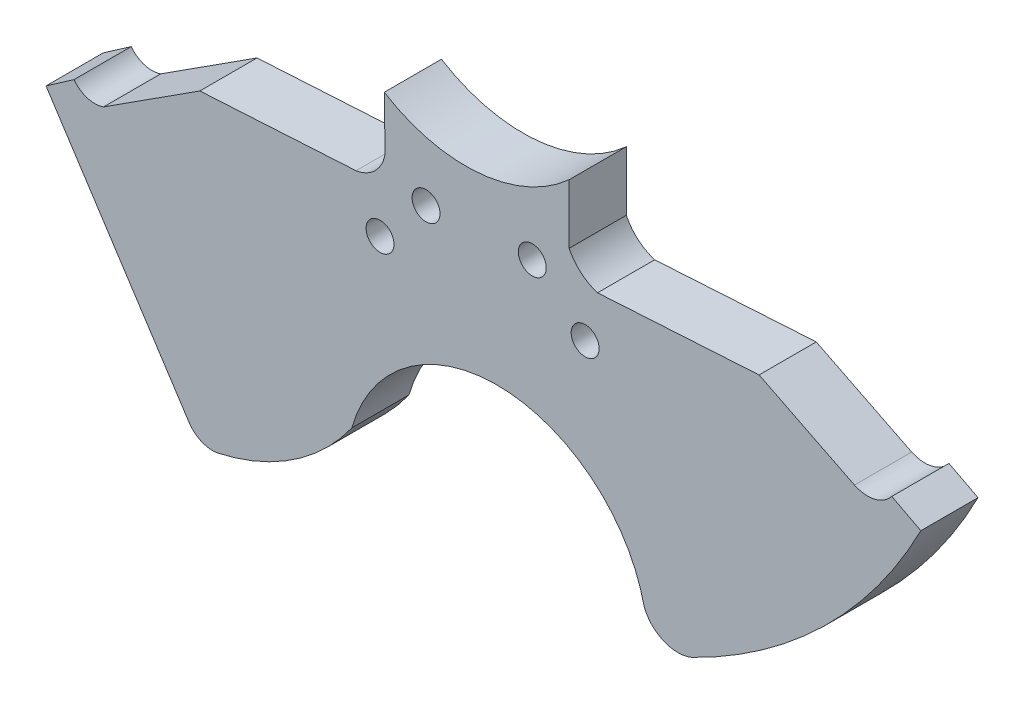
ISO-10303-21;
HEADER;
FILE_DESCRIPTION(('STEP AP214'),'2;1');
FILE_NAME('part.step','',(''),(''),'','','');
FILE_SCHEMA(('AUTOMOTIVE_DESIGN { 1 0 10303 214 1 1 1 1 }'));
ENDSEC;
DATA;
#1=APPLICATION_CONTEXT('core data for automotive mechanical design processes');
#2=APPLICATION_PROTOCOL_DEFINITION('international standard','automotive_design',2000,#1);
#3=PRODUCT_CONTEXT('',#1,'mechanical');
#4=PRODUCT('Part','Part','',(#3));
#5=PRODUCT_RELATED_PRODUCT_CATEGORY('part','',(#4));
#6=PRODUCT_DEFINITION_FORMATION('','',#4);
#7=PRODUCT_DEFINITION_CONTEXT('part definition',#1,'design');
#8=PRODUCT_DEFINITION('design','',#6,#7);
#9=PRODUCT_DEFINITION_SHAPE('','',#8);
#10=(LENGTH_UNIT() NAMED_UNIT(*) SI_UNIT(.MILLI.,.METRE.));
#11=(NAMED_UNIT(*) PLANE_ANGLE_UNIT() SI_UNIT($,.RADIAN.));
#12=(NAMED_UNIT(*) SI_UNIT($,.STERADIAN.) SOLID_ANGLE_UNIT());
#13=UNCERTAINTY_MEASURE_WITH_UNIT(LENGTH_MEASURE(1.E-05),#10,'distance_accuracy_value','');
#14=(GEOMETRIC_REPRESENTATION_CONTEXT(3) GLOBAL_UNCERTAINTY_ASSIGNED_CONTEXT((#13)) GLOBAL_UNIT_ASSIGNED_CONTEXT((#10,
#11,#12)) REPRESENTATION_CONTEXT('',''));
#15=CARTESIAN_POINT('',(0.,0.,0.));
#16=DIRECTION('',(0.,0.,1.));
#17=DIRECTION('',(1.,0.,0.));
#18=AXIS2_PLACEMENT_3D('',#15,#16,#17);
#19=CARTESIAN_POINT('',(31.1758611316786,56.598658808303,13.));
#20=DIRECTION('',(0.,0.,1.));
#21=DIRECTION('',(1.,0.,0.));
#22=AXIS2_PLACEMENT_3D('',#19,#20,#21);
#23=PLANE('',#22);
#24=CARTESIAN_POINT('',(125.590943676539,70.9466405765813,13.));
#25=DIRECTION('',(0.,0.,1.));
#26=DIRECTION('',(1.,0.,0.));
#27=AXIS2_PLACEMENT_3D('',#24,#25,#26);
#28=CIRCLE('',#27,3.175);
#29=CARTESIAN_POINT('',(128.765943676539,70.9466405765813,13.));
#30=VERTEX_POINT('',#29);
#31=EDGE_CURVE('E400',#30,#30,#28,.T.);
#32=ORIENTED_EDGE('',*,*,#31,.F.);
#33=EDGE_LOOP('',(#32));
#34=FACE_BOUND('',#33,.T.);
#35=CARTESIAN_POINT('',(89.4219487246209,79.437523552383,13.));
#36=DIRECTION('',(0.,0.,1.));
#37=DIRECTION('',(1.,0.,0.));
#38=AXIS2_PLACEMENT_3D('',#35,#36,#37);
#39=CIRCLE('',#38,3.175);
#40=CARTESIAN_POINT('',(92.5969487246209,79.437523552383,13.));
#41=VERTEX_POINT('',#40);
#42=EDGE_CURVE('E210',#41,#41,#39,.T.);
#43=ORIENTED_EDGE('',*,*,#42,.F.);
#44=EDGE_LOOP('',(#43));
#45=FACE_BOUND('',#44,.T.);
#46=CARTESIAN_POINT('',(31.1758611316786,56.598658808303,13.));
#47=DIRECTION('',(0.,0.,1.));
#48=DIRECTION('',(1.,0.,0.));
#49=AXIS2_PLACEMENT_3D('',#46,#47,#48);
#50=CIRCLE('',#49,50.7268128101961);
#51=CARTESIAN_POINT('',(41.9707942522505,7.03376239155412,13.));
#52=VERTEX_POINT('',#51);
#53=CARTESIAN_POINT('',(72.5465331391852,27.2443229185579,13.));
#54=VERTEX_POINT('',#53);
#55=EDGE_CURVE('E247',#52,#54,#50,.T.);
#56=ORIENTED_EDGE('',*,*,#55,.T.);
#57=CARTESIAN_POINT('',(105.533884862058,17.9301942944366,13.));
#58=DIRECTION('',(0.,0.,-1.));
#59=DIRECTION('',(1.,0.,0.));
#60=AXIS2_PLACEMENT_3D('',#57,#58,#59);
#61=CIRCLE('',#60,34.2770822228963);
#62=CARTESIAN_POINT('',(139.02060050713,25.2485439049202,13.));
#63=VERTEX_POINT('',#62);
#64=EDGE_CURVE('E132',#54,#63,#61,.T.);
#65=ORIENTED_EDGE('',*,*,#64,.T.);
#66=CARTESIAN_POINT('',(146.672078870646,28.3200737362575,13.));
#67=DIRECTION('',(0.,0.,1.));
#68=DIRECTION('',(1.,0.,0.));
#69=AXIS2_PLACEMENT_3D('',#66,#67,#68);
#70=CIRCLE('',#69,8.24496310799132);
#71=CARTESIAN_POINT('',(149.813666262393,20.6970923436426,13.));
#72=VERTEX_POINT('',#71);
#73=EDGE_CURVE('E298',#63,#72,#70,.T.);
#74=ORIENTED_EDGE('',*,*,#73,.T.);
#75=CARTESIAN_POINT('',(99.1919266210141,124.512117825493,13.));
#76=DIRECTION('',(0.,0.,1.));
#77=DIRECTION('',(1.,0.,0.));
#78=AXIS2_PLACEMENT_3D('',#75,#76,#77);
#79=CIRCLE('',#78,115.499437401733);
#80=CARTESIAN_POINT('',(201.904648358814,71.6896147294639,13.));
#81=VERTEX_POINT('',#80);
#82=EDGE_CURVE('E316',#72,#81,#79,.T.);
#83=ORIENTED_EDGE('',*,*,#82,.T.);
#84=DIRECTION('',(-0.886046208707076,0.463596932729086,0.));
#85=VECTOR('',#84,1.);
#86=CARTESIAN_POINT('',(195.305426607575,75.1424583082857,13.));
#87=LINE('',#86,#85);
#88=CARTESIAN_POINT('',(195.305426607575,75.1424583082857,13.));
#89=VERTEX_POINT('',#88);
#90=EDGE_CURVE('E313',#81,#89,#87,.T.);
#91=ORIENTED_EDGE('',*,*,#90,.T.);
#92=CARTESIAN_POINT('',(189.81215610492,79.437523552383,13.));
#93=DIRECTION('',(0.,0.,-1.));
#94=DIRECTION('',(1.,0.,0.));
#95=AXIS2_PLACEMENT_3D('',#92,#93,#94);
#96=CIRCLE('',#95,6.97306290423325);
#97=CARTESIAN_POINT('',(186.825026221145,73.1366774723828,13.));
#98=VERTEX_POINT('',#97);
#99=EDGE_CURVE('E315',#89,#98,#96,.T.);
#100=ORIENTED_EDGE('',*,*,#99,.T.);
#101=DIRECTION('',(-0.894590616533055,0.44688659502273,0.));
#102=VECTOR('',#101,1.);
#103=CARTESIAN_POINT('',(165.135958913829,83.97130200237,13.));
#104=LINE('',#103,#102);
#105=CARTESIAN_POINT('',(165.135958913829,83.97130200237,13.));
#106=VERTEX_POINT('',#105);
#107=EDGE_CURVE('E318',#98,#106,#104,.T.);
#108=ORIENTED_EDGE('',*,*,#107,.T.);
#109=DIRECTION('',(-0.998215385860333,-0.0597163581584402,0.));
#110=VECTOR('',#109,1.);
#111=CARTESIAN_POINT('',(128.400566481873,81.7736762367975,13.));
#112=LINE('',#111,#110);
#113=CARTESIAN_POINT('',(128.400566481873,81.7736762367975,13.));
#114=VERTEX_POINT('',#113);
#115=EDGE_CURVE('E324',#106,#114,#112,.T.);
#116=ORIENTED_EDGE('',*,*,#115,.T.);
#117=CARTESIAN_POINT('',(131.621533108597,92.0615282670931,13.));
#118=DIRECTION('',(0.,0.,-1.));
#119=DIRECTION('',(-1.,0.,0.));
#120=AXIS2_PLACEMENT_3D('',#117,#118,#119);
#121=CIRCLE('',#120,10.7802841060767);
#122=CARTESIAN_POINT('',(121.946388489439,87.3069407974904,13.));
#123=VERTEX_POINT('',#122);
#124=EDGE_CURVE('E326',#114,#123,#121,.T.);
#125=ORIENTED_EDGE('',*,*,#124,.T.);
#126=DIRECTION('',(0.,1.,0.));
#127=VECTOR('',#126,1.);
#128=CARTESIAN_POINT('',(121.946388489439,87.3069407974904,13.));
#129=LINE('',#128,#127);
#130=CARTESIAN_POINT('',(121.946388489439,100.812163968302,13.));
#131=VERTEX_POINT('',#130);
#132=EDGE_CURVE('E328',#123,#131,#129,.T.);
#133=ORIENTED_EDGE('',*,*,#132,.T.);
#134=CARTESIAN_POINT('',(98.4335474973241,126.737948594414,13.));
#135=DIRECTION('',(0.,0.,-1.));
#136=DIRECTION('',(1.,0.,0.));
#137=AXIS2_PLACEMENT_3D('',#134,#135,#136);
#138=CIRCLE('',#137,35.);
#139=CARTESIAN_POINT('',(79.9300030730231,97.0290468352119,13.));
#140=VERTEX_POINT('',#139);
#141=EDGE_CURVE('E330',#131,#140,#138,.T.);
#142=ORIENTED_EDGE('',*,*,#141,.T.);
#143=DIRECTION('',(0.,-1.,0.));
#144=VECTOR('',#143,1.);
#145=CARTESIAN_POINT('',(79.9300030730231,94.4157062863793,13.));
#146=LINE('',#145,#144);
#147=CARTESIAN_POINT('',(79.9300030730231,94.4157062863793,13.));
#148=VERTEX_POINT('',#147);
#149=EDGE_CURVE('E332',#140,#148,#146,.T.);
#150=ORIENTED_EDGE('',*,*,#149,.T.);
#151=DIRECTION('',(0.0230202138103884,-0.9997349997655,0.));
#152=VECTOR('',#151,1.);
#153=CARTESIAN_POINT('',(79.9300030730231,94.4157062863793,13.));
#154=LINE('',#153,#152);
#155=CARTESIAN_POINT('',(80.1404566584949,85.2760077173204,13.));
#156=VERTEX_POINT('',#155);
#157=EDGE_CURVE('E334',#148,#156,#154,.T.);
#158=ORIENTED_EDGE('',*,*,#157,.T.);
#159=CARTESIAN_POINT('',(72.2931673645886,86.165958455485,13.));
#160=DIRECTION('',(0.,0.,-1.));
#161=DIRECTION('',(1.,0.,0.));
#162=AXIS2_PLACEMENT_3D('',#159,#160,#161);
#163=CIRCLE('',#162,7.89759213802641);
#164=CARTESIAN_POINT('',(73.5101813950039,78.3627002623718,13.));
#165=VERTEX_POINT('',#164);
#166=EDGE_CURVE('E336',#156,#165,#163,.T.);
#167=ORIENTED_EDGE('',*,*,#166,.T.);
#168=DIRECTION('',(-0.998334823171534,-0.0576851873799673,0.));
#169=VECTOR('',#168,1.);
#170=CARTESIAN_POINT('',(37.9957349827681,76.3106256993736,13.));
#171=LINE('',#170,#169);
#172=CARTESIAN_POINT('',(37.9957349827681,76.3106256993736,13.));
#173=VERTEX_POINT('',#172);
#174=EDGE_CURVE('E338',#165,#173,#171,.T.);
#175=ORIENTED_EDGE('',*,*,#174,.T.);
#176=DIRECTION('',(-0.841061575299964,-0.540939392680865,0.));
#177=VECTOR('',#176,1.);
#178=CARTESIAN_POINT('',(16.1166455498494,62.2388125315537,13.));
#179=LINE('',#178,#177);
#180=CARTESIAN_POINT('',(16.1166455498494,62.2388125315537,13.));
#181=VERTEX_POINT('',#180);
#182=EDGE_CURVE('E340',#173,#181,#179,.T.);
#183=ORIENTED_EDGE('',*,*,#182,.T.);
#184=CARTESIAN_POINT('',(14.111686575733,67.8039482515331,13.));
#185=DIRECTION('',(0.,0.,-1.));
#186=DIRECTION('',(1.,0.,0.));
#187=AXIS2_PLACEMENT_3D('',#184,#185,#186);
#188=CIRCLE('',#187,5.91528495253441);
#189=CARTESIAN_POINT('',(9.38959245705728,64.2413055239994,13.));
#190=VERTEX_POINT('',#189);
#191=EDGE_CURVE('E187',#181,#190,#188,.T.);
#192=ORIENTED_EDGE('',*,*,#191,.T.);
#193=DIRECTION('',(-0.821446867234653,-0.570285055310389,0.));
#194=VECTOR('',#193,1.);
#195=CARTESIAN_POINT('',(9.38959245705729,64.2413055239994,13.));
#196=LINE('',#195,#194);
#197=CARTESIAN_POINT('',(3.02296585617206,59.8213093586366,13.));
#198=VERTEX_POINT('',#197);
#199=EDGE_CURVE('E181',#190,#198,#196,.T.);
#200=ORIENTED_EDGE('',*,*,#199,.T.);
#201=DIRECTION('',(0.54531366976146,-0.838232069042511,0.));
#202=VECTOR('',#201,1.);
#203=CARTESIAN_POINT('',(35.3852300374902,10.0754673454095,13.));
#204=LINE('',#203,#202);
#205=CARTESIAN_POINT('',(35.662068876128,9.64992291956711,13.));
#206=VERTEX_POINT('',#205);
#207=EDGE_CURVE('E185',#198,#206,#204,.T.);
#208=ORIENTED_EDGE('',*,*,#207,.T.);
#209=CARTESIAN_POINT('',(40.896615145089,13.3580894811264,13.));
#210=DIRECTION('',(0.,0.,1.));
#211=DIRECTION('',(-1.,0.,0.));
#212=AXIS2_PLACEMENT_3D('',#209,#210,#211);
#213=CIRCLE('',#212,6.41490248485194);
#214=EDGE_CURVE('E54',#206,#52,#213,.T.);
#215=ORIENTED_EDGE('',*,*,#214,.T.);
#216=EDGE_LOOP('',(#56,#65,#74,#83,#91,#100,#108,#116,#125,#133,#142,#150,#158,#167,#175,#183,
#192,#200,#208,#215));
#217=FACE_BOUND('',#216,.T.);
#218=CARTESIAN_POINT('',(113.57255848616,80.8498296610087,13.));
#219=DIRECTION('',(0.,0.,1.));
#220=DIRECTION('',(1.,0.,0.));
#221=AXIS2_PLACEMENT_3D('',#218,#219,#220);
#222=CIRCLE('',#221,3.175);
#223=CARTESIAN_POINT('',(116.74755848616,80.8498296610087,13.));
#224=VERTEX_POINT('',#223);
#225=EDGE_CURVE('E406',#224,#224,#222,.T.);
#226=ORIENTED_EDGE('',*,*,#225,.F.);
#227=EDGE_LOOP('',(#226));
#228=FACE_BOUND('',#227,.T.);
#229=CARTESIAN_POINT('',(78.9651423833003,68.1797734966131,13.));
#230=DIRECTION('',(0.,0.,1.));
#231=DIRECTION('',(1.,0.,0.));
#232=AXIS2_PLACEMENT_3D('',#229,#230,#231);
#233=CIRCLE('',#232,3.175);
#234=CARTESIAN_POINT('',(82.1401423833003,68.1797734966131,13.));
#235=VERTEX_POINT('',#234);
#236=EDGE_CURVE('E391',#235,#235,#233,.T.);
#237=ORIENTED_EDGE('',*,*,#236,.F.);
#238=EDGE_LOOP('',(#237));
#239=FACE_BOUND('',#238,.T.);
#240=ADVANCED_FACE('F37',(#34,#45,#217,#228,#239),#23,.T.);
#241=CARTESIAN_POINT('',(31.1758611316786,56.598658808303,0.));
#242=DIRECTION('',(0.,0.,1.));
#243=DIRECTION('',(1.,0.,0.));
#244=AXIS2_PLACEMENT_3D('',#241,#242,#243);
#245=PLANE('',#244);
#246=CARTESIAN_POINT('',(31.1758611316786,56.598658808303,0.));
#247=DIRECTION('',(0.,0.,1.));
#248=DIRECTION('',(1.,0.,0.));
#249=AXIS2_PLACEMENT_3D('',#246,#247,#248);
#250=CIRCLE('',#249,50.7268128101961);
#251=CARTESIAN_POINT('',(41.9707942522505,7.03376239155412,0.));
#252=VERTEX_POINT('',#251);
#253=CARTESIAN_POINT('',(72.5465331391852,27.2443229185579,0.));
#254=VERTEX_POINT('',#253);
#255=EDGE_CURVE('E206',#252,#254,#250,.T.);
#256=ORIENTED_EDGE('',*,*,#255,.F.);
#257=CARTESIAN_POINT('',(40.896615145089,13.3580894811264,0.));
#258=DIRECTION('',(0.,0.,1.));
#259=DIRECTION('',(-1.,0.,0.));
#260=AXIS2_PLACEMENT_3D('',#257,#258,#259);
#261=CIRCLE('',#260,6.41490248485194);
#262=CARTESIAN_POINT('',(35.662068876128,9.64992291956711,0.));
#263=VERTEX_POINT('',#262);
#264=EDGE_CURVE('E124',#263,#252,#261,.T.);
#265=ORIENTED_EDGE('',*,*,#264,.F.);
#266=DIRECTION('',(0.545313669761459,-0.838232069042512,0.));
#267=VECTOR('',#266,1.);
#268=CARTESIAN_POINT('',(35.662068876128,9.64992291956711,0.));
#269=LINE('',#268,#267);
#270=CARTESIAN_POINT('',(3.02296585617206,59.8213093586366,0.));
#271=VERTEX_POINT('',#270);
#272=EDGE_CURVE('E118',#271,#263,#269,.T.);
#273=ORIENTED_EDGE('',*,*,#272,.F.);
#274=DIRECTION('',(-0.821446867234653,-0.570285055310389,0.));
#275=VECTOR('',#274,1.);
#276=CARTESIAN_POINT('',(9.38959245705729,64.2413055239994,0.));
#277=LINE('',#276,#275);
#278=CARTESIAN_POINT('',(9.38959245705728,64.2413055239994,0.));
#279=VERTEX_POINT('',#278);
#280=EDGE_CURVE('E196',#279,#271,#277,.T.);
#281=ORIENTED_EDGE('',*,*,#280,.F.);
#282=CARTESIAN_POINT('',(14.111686575733,67.8039482515331,0.));
#283=DIRECTION('',(0.,0.,-1.));
#284=DIRECTION('',(1.,0.,0.));
#285=AXIS2_PLACEMENT_3D('',#282,#283,#284);
#286=CIRCLE('',#285,5.91528495253441);
#287=CARTESIAN_POINT('',(16.1166455498494,62.2388125315537,0.));
#288=VERTEX_POINT('',#287);
#289=EDGE_CURVE('E242',#288,#279,#286,.T.);
#290=ORIENTED_EDGE('',*,*,#289,.F.);
#291=DIRECTION('',(-0.841061575299964,-0.540939392680865,0.));
#292=VECTOR('',#291,1.);
#293=CARTESIAN_POINT('',(16.1166455498494,62.2388125315537,0.));
#294=LINE('',#293,#292);
#295=CARTESIAN_POINT('',(37.9957349827681,76.3106256993736,0.));
#296=VERTEX_POINT('',#295);
#297=EDGE_CURVE('E240',#296,#288,#294,.T.);
#298=ORIENTED_EDGE('',*,*,#297,.F.);
#299=DIRECTION('',(-0.998334823171534,-0.0576851873799673,0.));
#300=VECTOR('',#299,1.);
#301=CARTESIAN_POINT('',(37.9957349827681,76.3106256993736,0.));
#302=LINE('',#301,#300);
#303=CARTESIAN_POINT('',(73.5101813950039,78.3627002623718,0.));
#304=VERTEX_POINT('',#303);
#305=EDGE_CURVE('E238',#304,#296,#302,.T.);
#306=ORIENTED_EDGE('',*,*,#305,.F.);
#307=CARTESIAN_POINT('',(72.2931673645886,86.165958455485,0.));
#308=DIRECTION('',(0.,0.,-1.));
#309=DIRECTION('',(1.,0.,0.));
#310=AXIS2_PLACEMENT_3D('',#307,#308,#309);
#311=CIRCLE('',#310,7.89759213802641);
#312=CARTESIAN_POINT('',(80.1404566584949,85.2760077173204,0.));
#313=VERTEX_POINT('',#312);
#314=EDGE_CURVE('E236',#313,#304,#311,.T.);
#315=ORIENTED_EDGE('',*,*,#314,.F.);
#316=DIRECTION('',(0.0230202138103884,-0.9997349997655,0.));
#317=VECTOR('',#316,1.);
#318=CARTESIAN_POINT('',(79.9300030730231,94.4157062863793,0.));
#319=LINE('',#318,#317);
#320=CARTESIAN_POINT('',(79.9300030730231,94.4157062863793,0.));
#321=VERTEX_POINT('',#320);
#322=EDGE_CURVE('E234',#321,#313,#319,.T.);
#323=ORIENTED_EDGE('',*,*,#322,.F.);
#324=DIRECTION('',(0.,-1.,0.));
#325=VECTOR('',#324,1.);
#326=CARTESIAN_POINT('',(79.9300030730231,94.4157062863793,0.));
#327=LINE('',#326,#325);
#328=CARTESIAN_POINT('',(79.9300030730231,97.0290468352119,0.));
#329=VERTEX_POINT('',#328);
#330=EDGE_CURVE('E232',#329,#321,#327,.T.);
#331=ORIENTED_EDGE('',*,*,#330,.F.);
#332=CARTESIAN_POINT('',(98.4335474973241,126.737948594414,0.));
#333=DIRECTION('',(0.,0.,-1.));
#334=DIRECTION('',(1.,0.,0.));
#335=AXIS2_PLACEMENT_3D('',#332,#333,#334);
#336=CIRCLE('',#335,35.);
#337=CARTESIAN_POINT('',(121.946388489439,100.812163968302,0.));
#338=VERTEX_POINT('',#337);
#339=EDGE_CURVE('E230',#338,#329,#336,.T.);
#340=ORIENTED_EDGE('',*,*,#339,.F.);
#341=DIRECTION('',(0.,1.,0.));
#342=VECTOR('',#341,1.);
#343=CARTESIAN_POINT('',(121.946388489439,97.8544790562696,0.));
#344=LINE('',#343,#342);
#345=CARTESIAN_POINT('',(121.946388489439,87.3069407974904,0.));
#346=VERTEX_POINT('',#345);
#347=EDGE_CURVE('E228',#346,#338,#344,.T.);
#348=ORIENTED_EDGE('',*,*,#347,.F.);
#349=CARTESIAN_POINT('',(131.621533108597,92.0615282670931,0.));
#350=DIRECTION('',(0.,0.,-1.));
#351=DIRECTION('',(-1.,0.,0.));
#352=AXIS2_PLACEMENT_3D('',#349,#350,#351);
#353=CIRCLE('',#352,10.7802841060767);
#354=CARTESIAN_POINT('',(128.400566481873,81.7736762367975,0.));
#355=VERTEX_POINT('',#354);
#356=EDGE_CURVE('E225',#355,#346,#353,.T.);
#357=ORIENTED_EDGE('',*,*,#356,.F.);
#358=DIRECTION('',(-0.998215385860333,-0.0597163581584402,0.));
#359=VECTOR('',#358,1.);
#360=CARTESIAN_POINT('',(128.400566481873,81.7736762367975,0.));
#361=LINE('',#360,#359);
#362=CARTESIAN_POINT('',(165.135958913829,83.97130200237,0.));
#363=VERTEX_POINT('',#362);
#364=EDGE_CURVE('E223',#363,#355,#361,.T.);
#365=ORIENTED_EDGE('',*,*,#364,.F.);
#366=DIRECTION('',(-0.894590616533055,0.44688659502273,0.));
#367=VECTOR('',#366,1.);
#368=CARTESIAN_POINT('',(165.135958913829,83.97130200237,0.));
#369=LINE('',#368,#367);
#370=CARTESIAN_POINT('',(186.825026221145,73.1366774723828,0.));
#371=VERTEX_POINT('',#370);
#372=EDGE_CURVE('E221',#371,#363,#369,.T.);
#373=ORIENTED_EDGE('',*,*,#372,.F.);
#374=CARTESIAN_POINT('',(189.81215610492,79.437523552383,0.));
#375=DIRECTION('',(0.,0.,-1.));
#376=DIRECTION('',(1.,0.,0.));
#377=AXIS2_PLACEMENT_3D('',#374,#375,#376);
#378=CIRCLE('',#377,6.97306290423325);
#379=CARTESIAN_POINT('',(195.305426607575,75.1424583082857,0.));
#380=VERTEX_POINT('',#379);
#381=EDGE_CURVE('E219',#380,#371,#378,.T.);
#382=ORIENTED_EDGE('',*,*,#381,.F.);
#383=DIRECTION('',(-0.886046208707076,0.463596932729086,0.));
#384=VECTOR('',#383,1.);
#385=CARTESIAN_POINT('',(195.305426607575,75.1424583082857,0.));
#386=LINE('',#385,#384);
#387=CARTESIAN_POINT('',(201.904648358814,71.6896147294639,0.));
#388=VERTEX_POINT('',#387);
#389=EDGE_CURVE('E217',#388,#380,#386,.T.);
#390=ORIENTED_EDGE('',*,*,#389,.F.);
#391=CARTESIAN_POINT('',(99.1919266210141,124.512117825493,0.));
#392=DIRECTION('',(0.,0.,1.));
#393=DIRECTION('',(1.,0.,0.));
#394=AXIS2_PLACEMENT_3D('',#391,#392,#393);
#395=CIRCLE('',#394,115.499437401733);
#396=CARTESIAN_POINT('',(149.813666262393,20.6970923436426,0.));
#397=VERTEX_POINT('',#396);
#398=EDGE_CURVE('E215',#397,#388,#395,.T.);
#399=ORIENTED_EDGE('',*,*,#398,.F.);
#400=CARTESIAN_POINT('',(146.672078870646,28.3200737362575,0.));
#401=DIRECTION('',(0.,0.,1.));
#402=DIRECTION('',(1.,0.,0.));
#403=AXIS2_PLACEMENT_3D('',#400,#401,#402);
#404=CIRCLE('',#403,8.24496310799132);
#405=CARTESIAN_POINT('',(139.02060050713,25.2485439049202,0.));
#406=VERTEX_POINT('',#405);
#407=EDGE_CURVE('E212',#406,#397,#404,.T.);
#408=ORIENTED_EDGE('',*,*,#407,.F.);
#409=CARTESIAN_POINT('',(105.533884862058,17.9301942944366,0.));
#410=DIRECTION('',(0.,0.,-1.));
#411=DIRECTION('',(1.,0.,0.));
#412=AXIS2_PLACEMENT_3D('',#409,#410,#411);
#413=CIRCLE('',#412,34.2770822228963);
#414=EDGE_CURVE('E209',#254,#406,#413,.T.);
#415=ORIENTED_EDGE('',*,*,#414,.F.);
#416=EDGE_LOOP('',(#256,#265,#273,#281,#290,#298,#306,#315,#323,#331,#340,#348,#357,#365,#373,
#382,#390,#399,#408,#415));
#417=FACE_BOUND('',#416,.T.);
#418=CARTESIAN_POINT('',(89.4219487246209,79.437523552383,0.));
#419=DIRECTION('',(0.,0.,1.));
#420=DIRECTION('',(1.,0.,0.));
#421=AXIS2_PLACEMENT_3D('',#418,#419,#420);
#422=CIRCLE('',#421,3.175);
#423=CARTESIAN_POINT('',(92.5969487246209,79.437523552383,0.));
#424=VERTEX_POINT('',#423);
#425=EDGE_CURVE('E409',#424,#424,#422,.T.);
#426=ORIENTED_EDGE('',*,*,#425,.T.);
#427=EDGE_LOOP('',(#426));
#428=FACE_BOUND('',#427,.T.);
#429=CARTESIAN_POINT('',(113.57255848616,80.8498296610087,0.));
#430=DIRECTION('',(0.,0.,1.));
#431=DIRECTION('',(1.,0.,0.));
#432=AXIS2_PLACEMENT_3D('',#429,#430,#431);
#433=CIRCLE('',#432,3.175);
#434=CARTESIAN_POINT('',(116.74755848616,80.8498296610087,0.));
#435=VERTEX_POINT('',#434);
#436=EDGE_CURVE('E403',#435,#435,#433,.T.);
#437=ORIENTED_EDGE('',*,*,#436,.T.);
#438=EDGE_LOOP('',(#437));
#439=FACE_BOUND('',#438,.T.);
#440=CARTESIAN_POINT('',(125.590943676539,70.9466405765813,0.));
#441=DIRECTION('',(0.,0.,1.));
#442=DIRECTION('',(1.,0.,0.));
#443=AXIS2_PLACEMENT_3D('',#440,#441,#442);
#444=CIRCLE('',#443,3.175);
#445=CARTESIAN_POINT('',(128.765943676539,70.9466405765813,0.));
#446=VERTEX_POINT('',#445);
#447=EDGE_CURVE('E397',#446,#446,#444,.T.);
#448=ORIENTED_EDGE('',*,*,#447,.T.);
#449=EDGE_LOOP('',(#448));
#450=FACE_BOUND('',#449,.T.);
#451=CARTESIAN_POINT('',(78.9651423833003,68.1797734966131,0.));
#452=DIRECTION('',(0.,0.,1.));
#453=DIRECTION('',(1.,0.,0.));
#454=AXIS2_PLACEMENT_3D('',#451,#452,#453);
#455=CIRCLE('',#454,3.175);
#456=CARTESIAN_POINT('',(82.1401423833003,68.1797734966131,0.));
#457=VERTEX_POINT('',#456);
#458=EDGE_CURVE('E394',#457,#457,#455,.T.);
#459=ORIENTED_EDGE('',*,*,#458,.T.);
#460=EDGE_LOOP('',(#459));
#461=FACE_BOUND('',#460,.T.);
#462=ADVANCED_FACE('F301',(#417,#428,#439,#450,#461),#245,.F.);
#463=CARTESIAN_POINT('',(31.1758611316786,56.598658808303,13.));
#464=DIRECTION('',(0.,0.,-1.));
#465=DIRECTION('',(-1.,0.,0.));
#466=AXIS2_PLACEMENT_3D('',#463,#464,#465);
#467=CYLINDRICAL_SURFACE('',#466,50.7268128101961);
#468=ORIENTED_EDGE('',*,*,#255,.T.);
#469=DIRECTION('',(0.,0.,-1.));
#470=VECTOR('',#469,1.);
#471=CARTESIAN_POINT('',(72.5465331391852,27.2443229185579,13.));
#472=LINE('',#471,#470);
#473=EDGE_CURVE('E11',#54,#254,#472,.T.);
#474=ORIENTED_EDGE('',*,*,#473,.F.);
#475=ORIENTED_EDGE('',*,*,#55,.F.);
#476=DIRECTION('',(0.,0.,-1.));
#477=VECTOR('',#476,1.);
#478=CARTESIAN_POINT('',(41.9707942522505,7.03376239155412,13.));
#479=LINE('',#478,#477);
#480=EDGE_CURVE('E202',#52,#252,#479,.T.);
#481=ORIENTED_EDGE('',*,*,#480,.T.);
#482=EDGE_LOOP('',(#468,#474,#475,#481));
#483=FACE_BOUND('',#482,.T.);
#484=ADVANCED_FACE('F39',(#483),#467,.T.);
#485=CARTESIAN_POINT('',(105.533884862058,17.9301942944366,13.));
#486=DIRECTION('',(0.,0.,-1.));
#487=DIRECTION('',(-1.,0.,0.));
#488=AXIS2_PLACEMENT_3D('',#485,#486,#487);
#489=CYLINDRICAL_SURFACE('',#488,34.2770822228963);
#490=ORIENTED_EDGE('',*,*,#414,.T.);
#491=DIRECTION('',(0.,0.,-1.));
#492=VECTOR('',#491,1.);
#493=CARTESIAN_POINT('',(139.02060050713,25.2485439049202,13.));
#494=LINE('',#493,#492);
#495=EDGE_CURVE('E46',#63,#406,#494,.T.);
#496=ORIENTED_EDGE('',*,*,#495,.F.);
#497=ORIENTED_EDGE('',*,*,#64,.F.);
#498=ORIENTED_EDGE('',*,*,#473,.T.);
#499=EDGE_LOOP('',(#490,#496,#497,#498));
#500=FACE_BOUND('',#499,.T.);
#501=ADVANCED_FACE('F625',(#500),#489,.F.);
#502=CARTESIAN_POINT('',(146.672078870646,28.3200737362575,13.));
#503=DIRECTION('',(0.,0.,-1.));
#504=DIRECTION('',(-1.,0.,0.));
#505=AXIS2_PLACEMENT_3D('',#502,#503,#504);
#506=CYLINDRICAL_SURFACE('',#505,8.24496310799132);
#507=ORIENTED_EDGE('',*,*,#407,.T.);
#508=DIRECTION('',(0.,0.,-1.));
#509=VECTOR('',#508,1.);
#510=CARTESIAN_POINT('',(149.813666262393,20.6970923436426,13.));
#511=LINE('',#510,#509);
#512=EDGE_CURVE('E290',#72,#397,#511,.T.);
#513=ORIENTED_EDGE('',*,*,#512,.F.);
#514=ORIENTED_EDGE('',*,*,#73,.F.);
#515=ORIENTED_EDGE('',*,*,#495,.T.);
#516=EDGE_LOOP('',(#507,#513,#514,#515));
#517=FACE_BOUND('',#516,.T.);
#518=ADVANCED_FACE('F296',(#517),#506,.T.);
#519=CARTESIAN_POINT('',(99.1919266210141,124.512117825493,13.));
#520=DIRECTION('',(0.,0.,-1.));
#521=DIRECTION('',(-1.,0.,0.));
#522=AXIS2_PLACEMENT_3D('',#519,#520,#521);
#523=CYLINDRICAL_SURFACE('',#522,115.499437401733);
#524=ORIENTED_EDGE('',*,*,#398,.T.);
#525=DIRECTION('',(0.,0.,-1.));
#526=VECTOR('',#525,1.);
#527=CARTESIAN_POINT('',(201.904648358814,71.6896147294639,13.));
#528=LINE('',#527,#526);
#529=EDGE_CURVE('E287',#81,#388,#528,.T.);
#530=ORIENTED_EDGE('',*,*,#529,.F.);
#531=ORIENTED_EDGE('',*,*,#82,.F.);
#532=ORIENTED_EDGE('',*,*,#512,.T.);
#533=EDGE_LOOP('',(#524,#530,#531,#532));
#534=FACE_BOUND('',#533,.T.);
#535=ADVANCED_FACE('F307',(#534),#523,.T.);
#536=CARTESIAN_POINT('',(195.305426607575,75.1424583082857,13.));
#537=DIRECTION('',(-0.463596932729086,-0.886046208707076,0.));
#538=DIRECTION('',(0.886046208707076,-0.463596932729086,0.));
#539=AXIS2_PLACEMENT_3D('',#536,#537,#538);
#540=PLANE('',#539);
#541=ORIENTED_EDGE('',*,*,#389,.T.);
#542=DIRECTION('',(0.,0.,-1.));
#543=VECTOR('',#542,1.);
#544=CARTESIAN_POINT('',(195.305426607575,75.1424583082857,13.));
#545=LINE('',#544,#543);
#546=EDGE_CURVE('E284',#89,#380,#545,.T.);
#547=ORIENTED_EDGE('',*,*,#546,.F.);
#548=ORIENTED_EDGE('',*,*,#90,.F.);
#549=ORIENTED_EDGE('',*,*,#529,.T.);
#550=EDGE_LOOP('',(#541,#547,#548,#549));
#551=FACE_BOUND('',#550,.T.);
#552=ADVANCED_FACE('F311',(#551),#540,.F.);
#553=CARTESIAN_POINT('',(189.81215610492,79.437523552383,13.));
#554=DIRECTION('',(0.,0.,-1.));
#555=DIRECTION('',(-1.,0.,0.));
#556=AXIS2_PLACEMENT_3D('',#553,#554,#555);
#557=CYLINDRICAL_SURFACE('',#556,6.97306290423325);
#558=ORIENTED_EDGE('',*,*,#381,.T.);
#559=DIRECTION('',(0.,0.,-1.));
#560=VECTOR('',#559,1.);
#561=CARTESIAN_POINT('',(186.825026221145,73.1366774723828,13.));
#562=LINE('',#561,#560);
#563=EDGE_CURVE('E281',#98,#371,#562,.T.);
#564=ORIENTED_EDGE('',*,*,#563,.F.);
#565=ORIENTED_EDGE('',*,*,#99,.F.);
#566=ORIENTED_EDGE('',*,*,#546,.T.);
#567=EDGE_LOOP('',(#558,#564,#565,#566));
#568=FACE_BOUND('',#567,.T.);
#569=ADVANCED_FACE('F589',(#568),#557,.F.);
#570=CARTESIAN_POINT('',(165.135958913829,83.97130200237,13.));
#571=DIRECTION('',(-0.44688659502273,-0.894590616533054,0.));
#572=DIRECTION('',(0.894590616533054,-0.44688659502273,0.));
#573=AXIS2_PLACEMENT_3D('',#570,#571,#572);
#574=PLANE('',#573);
#575=ORIENTED_EDGE('',*,*,#372,.T.);
#576=DIRECTION('',(0.,0.,-1.));
#577=VECTOR('',#576,1.);
#578=CARTESIAN_POINT('',(165.135958913829,83.97130200237,13.));
#579=LINE('',#578,#577);
#580=EDGE_CURVE('E278',#106,#363,#579,.T.);
#581=ORIENTED_EDGE('',*,*,#580,.F.);
#582=ORIENTED_EDGE('',*,*,#107,.F.);
#583=ORIENTED_EDGE('',*,*,#563,.T.);
#584=EDGE_LOOP('',(#575,#581,#582,#583));
#585=FACE_BOUND('',#584,.T.);
#586=ADVANCED_FACE('F579',(#585),#574,.F.);
#587=CARTESIAN_POINT('',(128.400566481873,81.7736762367975,13.));
#588=DIRECTION('',(0.0597163581584402,-0.998215385860333,0.));
#589=DIRECTION('',(0.998215385860333,0.0597163581584402,0.));
#590=AXIS2_PLACEMENT_3D('',#587,#588,#589);
#591=PLANE('',#590);
#592=ORIENTED_EDGE('',*,*,#364,.T.);
#593=DIRECTION('',(0.,0.,-1.));
#594=VECTOR('',#593,1.);
#595=CARTESIAN_POINT('',(128.400566481873,81.7736762367975,13.));
#596=LINE('',#595,#594);
#597=EDGE_CURVE('E275',#114,#355,#596,.T.);
#598=ORIENTED_EDGE('',*,*,#597,.F.);
#599=ORIENTED_EDGE('',*,*,#115,.F.);
#600=ORIENTED_EDGE('',*,*,#580,.T.);
#601=EDGE_LOOP('',(#592,#598,#599,#600));
#602=FACE_BOUND('',#601,.T.);
#603=ADVANCED_FACE('F569',(#602),#591,.F.);
#604=CARTESIAN_POINT('',(131.621533108597,92.0615282670931,13.));
#605=DIRECTION('',(0.,0.,-1.));
#606=DIRECTION('',(-1.,0.,0.));
#607=AXIS2_PLACEMENT_3D('',#604,#605,#606);
#608=CYLINDRICAL_SURFACE('',#607,10.7802841060767);
#609=ORIENTED_EDGE('',*,*,#356,.T.);
#610=DIRECTION('',(0.,0.,-1.));
#611=VECTOR('',#610,1.);
#612=CARTESIAN_POINT('',(121.946388489439,87.3069407974904,13.));
#613=LINE('',#612,#611);
#614=EDGE_CURVE('E272',#123,#346,#613,.T.);
#615=ORIENTED_EDGE('',*,*,#614,.F.);
#616=ORIENTED_EDGE('',*,*,#124,.F.);
#617=ORIENTED_EDGE('',*,*,#597,.T.);
#618=EDGE_LOOP('',(#609,#615,#616,#617));
#619=FACE_BOUND('',#618,.T.);
#620=ADVANCED_FACE('F558',(#619),#608,.F.);
#621=CARTESIAN_POINT('',(121.946388489439,97.8544790562696,13.));
#622=DIRECTION('',(-1.,0.,0.));
#623=DIRECTION('',(0.,0.,1.));
#624=AXIS2_PLACEMENT_3D('',#621,#622,#623);
#625=PLANE('',#624);
#626=ORIENTED_EDGE('',*,*,#347,.T.);
#627=DIRECTION('',(0.,0.,-1.));
#628=VECTOR('',#627,1.);
#629=CARTESIAN_POINT('',(121.946388489439,100.812163968302,13.));
#630=LINE('',#629,#628);
#631=EDGE_CURVE('E269',#131,#338,#630,.T.);
#632=ORIENTED_EDGE('',*,*,#631,.F.);
#633=ORIENTED_EDGE('',*,*,#132,.F.);
#634=ORIENTED_EDGE('',*,*,#614,.T.);
#635=EDGE_LOOP('',(#626,#632,#633,#634));
#636=FACE_BOUND('',#635,.T.);
#637=ADVANCED_FACE('F548',(#636),#625,.F.);
#638=CARTESIAN_POINT('',(98.4335474973241,126.737948594414,13.));
#639=DIRECTION('',(0.,0.,-1.));
#640=DIRECTION('',(-1.,0.,0.));
#641=AXIS2_PLACEMENT_3D('',#638,#639,#640);
#642=CYLINDRICAL_SURFACE('',#641,35.);
#643=ORIENTED_EDGE('',*,*,#339,.T.);
#644=DIRECTION('',(0.,0.,-1.));
#645=VECTOR('',#644,1.);
#646=CARTESIAN_POINT('',(79.9300030730231,97.0290468352119,13.));
#647=LINE('',#646,#645);
#648=EDGE_CURVE('E266',#140,#329,#647,.T.);
#649=ORIENTED_EDGE('',*,*,#648,.F.);
#650=ORIENTED_EDGE('',*,*,#141,.F.);
#651=ORIENTED_EDGE('',*,*,#631,.T.);
#652=EDGE_LOOP('',(#643,#649,#650,#651));
#653=FACE_BOUND('',#652,.T.);
#654=ADVANCED_FACE('F538',(#653),#642,.F.);
#655=CARTESIAN_POINT('',(79.9300030730231,94.4157062863793,13.));
#656=DIRECTION('',(1.,0.,0.));
#657=DIRECTION('',(0.,0.,-1.));
#658=AXIS2_PLACEMENT_3D('',#655,#656,#657);
#659=PLANE('',#658);
#660=ORIENTED_EDGE('',*,*,#330,.T.);
#661=DIRECTION('',(0.,0.,-1.));
#662=VECTOR('',#661,1.);
#663=CARTESIAN_POINT('',(79.9300030730231,94.4157062863793,13.));
#664=LINE('',#663,#662);
#665=EDGE_CURVE('E263',#148,#321,#664,.T.);
#666=ORIENTED_EDGE('',*,*,#665,.F.);
#667=ORIENTED_EDGE('',*,*,#149,.F.);
#668=ORIENTED_EDGE('',*,*,#648,.T.);
#669=EDGE_LOOP('',(#660,#666,#667,#668));
#670=FACE_BOUND('',#669,.T.);
#671=ADVANCED_FACE('F528',(#670),#659,.F.);
#672=CARTESIAN_POINT('',(79.9300030730231,94.4157062863793,13.));
#673=DIRECTION('',(0.9997349997655,0.0230202138103884,0.));
#674=DIRECTION('',(-0.0230202138103884,0.9997349997655,0.));
#675=AXIS2_PLACEMENT_3D('',#672,#673,#674);
#676=PLANE('',#675);
#677=ORIENTED_EDGE('',*,*,#322,.T.);
#678=DIRECTION('',(0.,0.,-1.));
#679=VECTOR('',#678,1.);
#680=CARTESIAN_POINT('',(80.1404566584949,85.2760077173204,13.));
#681=LINE('',#680,#679);
#682=EDGE_CURVE('E260',#156,#313,#681,.T.);
#683=ORIENTED_EDGE('',*,*,#682,.F.);
#684=ORIENTED_EDGE('',*,*,#157,.F.);
#685=ORIENTED_EDGE('',*,*,#665,.T.);
#686=EDGE_LOOP('',(#677,#683,#684,#685));
#687=FACE_BOUND('',#686,.T.);
#688=ADVANCED_FACE('F518',(#687),#676,.F.);
#689=CARTESIAN_POINT('',(72.2931673645886,86.165958455485,13.));
#690=DIRECTION('',(0.,0.,-1.));
#691=DIRECTION('',(-1.,0.,0.));
#692=AXIS2_PLACEMENT_3D('',#689,#690,#691);
#693=CYLINDRICAL_SURFACE('',#692,7.89759213802641);
#694=ORIENTED_EDGE('',*,*,#314,.T.);
#695=DIRECTION('',(0.,0.,-1.));
#696=VECTOR('',#695,1.);
#697=CARTESIAN_POINT('',(73.5101813950039,78.3627002623718,13.));
#698=LINE('',#697,#696);
#699=EDGE_CURVE('E257',#165,#304,#698,.T.);
#700=ORIENTED_EDGE('',*,*,#699,.F.);
#701=ORIENTED_EDGE('',*,*,#166,.F.);
#702=ORIENTED_EDGE('',*,*,#682,.T.);
#703=EDGE_LOOP('',(#694,#700,#701,#702));
#704=FACE_BOUND('',#703,.T.);
#705=ADVANCED_FACE('F508',(#704),#693,.F.);
#706=CARTESIAN_POINT('',(37.9957349827681,76.3106256993736,13.));
#707=DIRECTION('',(0.0576851873799673,-0.998334823171534,0.));
#708=DIRECTION('',(0.998334823171534,0.0576851873799673,0.));
#709=AXIS2_PLACEMENT_3D('',#706,#707,#708);
#710=PLANE('',#709);
#711=ORIENTED_EDGE('',*,*,#305,.T.);
#712=DIRECTION('',(0.,0.,-1.));
#713=VECTOR('',#712,1.);
#714=CARTESIAN_POINT('',(37.9957349827681,76.3106256993736,13.));
#715=LINE('',#714,#713);
#716=EDGE_CURVE('E254',#173,#296,#715,.T.);
#717=ORIENTED_EDGE('',*,*,#716,.F.);
#718=ORIENTED_EDGE('',*,*,#174,.F.);
#719=ORIENTED_EDGE('',*,*,#699,.T.);
#720=EDGE_LOOP('',(#711,#717,#718,#719));
#721=FACE_BOUND('',#720,.T.);
#722=ADVANCED_FACE('F499',(#721),#710,.F.);
#723=CARTESIAN_POINT('',(16.1166455498494,62.2388125315537,13.));
#724=DIRECTION('',(0.540939392680865,-0.841061575299964,0.));
#725=DIRECTION('',(0.841061575299964,0.540939392680865,0.));
#726=AXIS2_PLACEMENT_3D('',#723,#724,#725);
#727=PLANE('',#726);
#728=ORIENTED_EDGE('',*,*,#297,.T.);
#729=DIRECTION('',(0.,0.,-1.));
#730=VECTOR('',#729,1.);
#731=CARTESIAN_POINT('',(16.1166455498494,62.2388125315537,13.));
#732=LINE('',#731,#730);
#733=EDGE_CURVE('E251',#181,#288,#732,.T.);
#734=ORIENTED_EDGE('',*,*,#733,.F.);
#735=ORIENTED_EDGE('',*,*,#182,.F.);
#736=ORIENTED_EDGE('',*,*,#716,.T.);
#737=EDGE_LOOP('',(#728,#734,#735,#736));
#738=FACE_BOUND('',#737,.T.);
#739=ADVANCED_FACE('F346',(#738),#727,.F.);
#740=CARTESIAN_POINT('',(14.111686575733,67.8039482515331,13.));
#741=DIRECTION('',(0.,0.,-1.));
#742=DIRECTION('',(-1.,0.,0.));
#743=AXIS2_PLACEMENT_3D('',#740,#741,#742);
#744=CYLINDRICAL_SURFACE('',#743,5.91528495253441);
#745=ORIENTED_EDGE('',*,*,#289,.T.);
#746=DIRECTION('',(0.,0.,-1.));
#747=VECTOR('',#746,1.);
#748=CARTESIAN_POINT('',(9.38959245705728,64.2413055239994,13.));
#749=LINE('',#748,#747);
#750=EDGE_CURVE('E197',#190,#279,#749,.T.);
#751=ORIENTED_EDGE('',*,*,#750,.F.);
#752=ORIENTED_EDGE('',*,*,#191,.F.);
#753=ORIENTED_EDGE('',*,*,#733,.T.);
#754=EDGE_LOOP('',(#745,#751,#752,#753));
#755=FACE_BOUND('',#754,.T.);
#756=ADVANCED_FACE('F350',(#755),#744,.F.);
#757=CARTESIAN_POINT('',(9.38959245705729,64.2413055239994,13.));
#758=DIRECTION('',(0.570285055310389,-0.821446867234653,0.));
#759=DIRECTION('',(0.821446867234653,0.57028505531039,0.));
#760=AXIS2_PLACEMENT_3D('',#757,#758,#759);
#761=PLANE('',#760);
#762=ORIENTED_EDGE('',*,*,#280,.T.);
#763=DIRECTION('',(0.,0.,-1.));
#764=VECTOR('',#763,1.);
#765=CARTESIAN_POINT('',(3.02296585617206,59.8213093586366,13.));
#766=LINE('',#765,#764);
#767=EDGE_CURVE('E193',#198,#271,#766,.T.);
#768=ORIENTED_EDGE('',*,*,#767,.F.);
#769=ORIENTED_EDGE('',*,*,#199,.F.);
#770=ORIENTED_EDGE('',*,*,#750,.T.);
#771=EDGE_LOOP('',(#762,#768,#769,#770));
#772=FACE_BOUND('',#771,.T.);
#773=ADVANCED_FACE('F194',(#772),#761,.F.);
#774=CARTESIAN_POINT('',(35.662068876128,9.64992291956711,13.));
#775=DIRECTION('',(0.838232069042512,0.545313669761459,0.));
#776=DIRECTION('',(-0.545313669761459,0.838232069042512,0.));
#777=AXIS2_PLACEMENT_3D('',#774,#775,#776);
#778=PLANE('',#777);
#779=ORIENTED_EDGE('',*,*,#272,.T.);
#780=DIRECTION('',(0.,0.,-1.));
#781=VECTOR('',#780,1.);
#782=CARTESIAN_POINT('',(35.662068876128,9.64992291956711,13.));
#783=LINE('',#782,#781);
#784=EDGE_CURVE('E198',#206,#263,#783,.T.);
#785=ORIENTED_EDGE('',*,*,#784,.F.);
#786=ORIENTED_EDGE('',*,*,#207,.F.);
#787=ORIENTED_EDGE('',*,*,#767,.T.);
#788=EDGE_LOOP('',(#779,#785,#786,#787));
#789=FACE_BOUND('',#788,.T.);
#790=ADVANCED_FACE('F200',(#789),#778,.F.);
#791=CARTESIAN_POINT('',(40.896615145089,13.3580894811264,13.));
#792=DIRECTION('',(0.,0.,-1.));
#793=DIRECTION('',(-1.,0.,0.));
#794=AXIS2_PLACEMENT_3D('',#791,#792,#793);
#795=CYLINDRICAL_SURFACE('',#794,6.41490248485194);
#796=ORIENTED_EDGE('',*,*,#264,.T.);
#797=ORIENTED_EDGE('',*,*,#480,.F.);
#798=ORIENTED_EDGE('',*,*,#214,.F.);
#799=ORIENTED_EDGE('',*,*,#784,.T.);
#800=EDGE_LOOP('',(#796,#797,#798,#799));
#801=FACE_BOUND('',#800,.T.);
#802=ADVANCED_FACE('F354',(#801),#795,.T.);
#803=CARTESIAN_POINT('',(89.4219487246209,79.437523552383,13.));
#804=DIRECTION('',(0.,0.,-1.));
#805=DIRECTION('',(-1.,0.,0.));
#806=AXIS2_PLACEMENT_3D('',#803,#804,#805);
#807=CYLINDRICAL_SURFACE('',#806,3.175);
#808=ORIENTED_EDGE('',*,*,#42,.T.);
#809=EDGE_LOOP('',(#808));
#810=FACE_BOUND('',#809,.T.);
#811=ORIENTED_EDGE('',*,*,#425,.F.);
#812=EDGE_LOOP('',(#811));
#813=FACE_BOUND('',#812,.T.);
#814=ADVANCED_FACE('F356',(#810,#813),#807,.F.);
#815=CARTESIAN_POINT('',(113.57255848616,80.8498296610087,13.));
#816=DIRECTION('',(0.,0.,-1.));
#817=DIRECTION('',(-1.,0.,0.));
#818=AXIS2_PLACEMENT_3D('',#815,#816,#817);
#819=CYLINDRICAL_SURFACE('',#818,3.175);
#820=ORIENTED_EDGE('',*,*,#225,.T.);
#821=EDGE_LOOP('',(#820));
#822=FACE_BOUND('',#821,.T.);
#823=ORIENTED_EDGE('',*,*,#436,.F.);
#824=EDGE_LOOP('',(#823));
#825=FACE_BOUND('',#824,.T.);
#826=ADVANCED_FACE('F362',(#822,#825),#819,.F.);
#827=CARTESIAN_POINT('',(125.590943676539,70.9466405765813,13.));
#828=DIRECTION('',(0.,0.,-1.));
#829=DIRECTION('',(-1.,0.,0.));
#830=AXIS2_PLACEMENT_3D('',#827,#828,#829);
#831=CYLINDRICAL_SURFACE('',#830,3.175);
#832=ORIENTED_EDGE('',*,*,#31,.T.);
#833=EDGE_LOOP('',(#832));
#834=FACE_BOUND('',#833,.T.);
#835=ORIENTED_EDGE('',*,*,#447,.F.);
#836=EDGE_LOOP('',(#835));
#837=FACE_BOUND('',#836,.T.);
#838=ADVANCED_FACE('F378',(#834,#837),#831,.F.);
#839=CARTESIAN_POINT('',(78.9651423833003,68.1797734966131,13.));
#840=DIRECTION('',(0.,0.,-1.));
#841=DIRECTION('',(-1.,0.,0.));
#842=AXIS2_PLACEMENT_3D('',#839,#840,#841);
#843=CYLINDRICAL_SURFACE('',#842,3.175);
#844=ORIENTED_EDGE('',*,*,#236,.T.);
#845=EDGE_LOOP('',(#844));
#846=FACE_BOUND('',#845,.T.);
#847=ORIENTED_EDGE('',*,*,#458,.F.);
#848=EDGE_LOOP('',(#847));
#849=FACE_BOUND('',#848,.T.);
#850=ADVANCED_FACE('F382',(#846,#849),#843,.F.);
#851=CLOSED_SHELL('',(#240,#462,#484,#501,#518,#535,#552,#569,#586,#603,#620,#637,#654,#671,
#688,#705,#722,#739,#756,#773,#790,#802,#814,#826,#838,#850));
#852=MANIFOLD_SOLID_BREP('B2',#851);
#853=ADVANCED_BREP_SHAPE_REPRESENTATION('',(#18,#852),#14);
#854=SHAPE_DEFINITION_REPRESENTATION(#9,#853);
ENDSEC;
END-ISO-10303-21;
